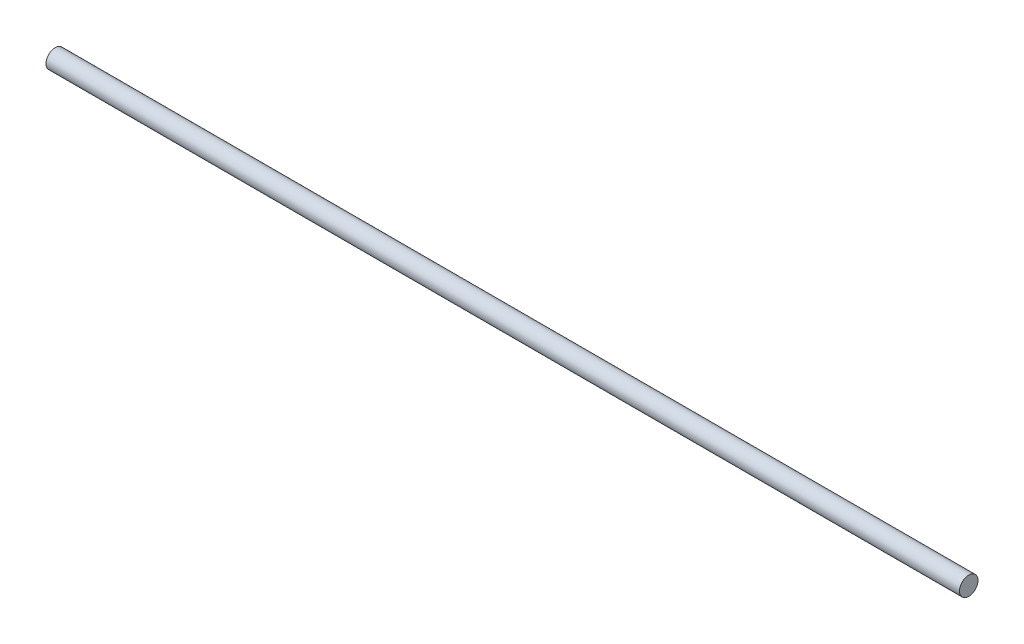
ISO-10303-21;
HEADER;
FILE_DESCRIPTION(('STEP AP214'),'2;1');
FILE_NAME('part.step','',(''),(''),'','','');
FILE_SCHEMA(('AUTOMOTIVE_DESIGN { 1 0 10303 214 1 1 1 1 }'));
ENDSEC;
DATA;
#1=APPLICATION_CONTEXT('core data for automotive mechanical design processes');
#2=APPLICATION_PROTOCOL_DEFINITION('international standard','automotive_design',2000,#1);
#3=PRODUCT_CONTEXT('',#1,'mechanical');
#4=PRODUCT('Part','Part','',(#3));
#5=PRODUCT_RELATED_PRODUCT_CATEGORY('part','',(#4));
#6=PRODUCT_DEFINITION_FORMATION('','',#4);
#7=PRODUCT_DEFINITION_CONTEXT('part definition',#1,'design');
#8=PRODUCT_DEFINITION('design','',#6,#7);
#9=PRODUCT_DEFINITION_SHAPE('','',#8);
#10=(LENGTH_UNIT() NAMED_UNIT(*) SI_UNIT(.MILLI.,.METRE.));
#11=(NAMED_UNIT(*) PLANE_ANGLE_UNIT() SI_UNIT($,.RADIAN.));
#12=(NAMED_UNIT(*) SI_UNIT($,.STERADIAN.) SOLID_ANGLE_UNIT());
#13=UNCERTAINTY_MEASURE_WITH_UNIT(LENGTH_MEASURE(1.E-05),#10,'distance_accuracy_value','');
#14=(GEOMETRIC_REPRESENTATION_CONTEXT(3) GLOBAL_UNCERTAINTY_ASSIGNED_CONTEXT((#13)) GLOBAL_UNIT_ASSIGNED_CONTEXT((#10,
#11,#12)) REPRESENTATION_CONTEXT('',''));
#15=CARTESIAN_POINT('',(0.,0.,0.));
#16=DIRECTION('',(0.,0.,1.));
#17=DIRECTION('',(1.,0.,0.));
#18=AXIS2_PLACEMENT_3D('',#15,#16,#17);
#19=CARTESIAN_POINT('',(395.00687984,0.,0.));
#20=DIRECTION('',(-1.,0.,0.));
#21=DIRECTION('',(0.,0.,1.));
#22=AXIS2_PLACEMENT_3D('',#19,#20,#21);
#23=CYLINDRICAL_SURFACE('',#22,4.);
#24=CARTESIAN_POINT('',(395.00687984,0.,0.));
#25=DIRECTION('',(1.,0.,0.));
#26=DIRECTION('',(0.,0.,-1.));
#27=AXIS2_PLACEMENT_3D('',#24,#25,#26);
#28=CIRCLE('',#27,4.);
#29=CARTESIAN_POINT('',(395.00687984,0.,-4.));
#30=VERTEX_POINT('',#29);
#31=EDGE_CURVE('E10',#30,#30,#28,.T.);
#32=ORIENTED_EDGE('',*,*,#31,.F.);
#33=EDGE_LOOP('',(#32));
#34=FACE_BOUND('',#33,.T.);
#35=CARTESIAN_POINT('',(0.,0.,0.));
#36=DIRECTION('',(1.,0.,0.));
#37=DIRECTION('',(0.,0.,-1.));
#38=AXIS2_PLACEMENT_3D('',#35,#36,#37);
#39=CIRCLE('',#38,4.);
#40=CARTESIAN_POINT('',(0.,0.,-4.));
#41=VERTEX_POINT('',#40);
#42=EDGE_CURVE('E35',#41,#41,#39,.T.);
#43=ORIENTED_EDGE('',*,*,#42,.T.);
#44=EDGE_LOOP('',(#43));
#45=FACE_BOUND('',#44,.T.);
#46=ADVANCED_FACE('F32',(#34,#45),#23,.T.);
#47=CARTESIAN_POINT('',(395.00687984,0.,0.));
#48=DIRECTION('',(1.,0.,0.));
#49=DIRECTION('',(0.,0.,-1.));
#50=AXIS2_PLACEMENT_3D('',#47,#48,#49);
#51=PLANE('',#50);
#52=ORIENTED_EDGE('',*,*,#31,.T.);
#53=EDGE_LOOP('',(#52));
#54=FACE_BOUND('',#53,.T.);
#55=ADVANCED_FACE('F47',(#54),#51,.T.);
#56=CARTESIAN_POINT('',(0.,0.,0.));
#57=DIRECTION('',(1.,0.,0.));
#58=DIRECTION('',(0.,0.,-1.));
#59=AXIS2_PLACEMENT_3D('',#56,#57,#58);
#60=PLANE('',#59);
#61=ORIENTED_EDGE('',*,*,#42,.F.);
#62=EDGE_LOOP('',(#61));
#63=FACE_BOUND('',#62,.T.);
#64=ADVANCED_FACE('F45',(#63),#60,.F.);
#65=CLOSED_SHELL('',(#46,#55,#64));
#66=MANIFOLD_SOLID_BREP('B2',#65);
#67=ADVANCED_BREP_SHAPE_REPRESENTATION('',(#18,#66),#14);
#68=SHAPE_DEFINITION_REPRESENTATION(#9,#67);
ENDSEC;
END-ISO-10303-21;
